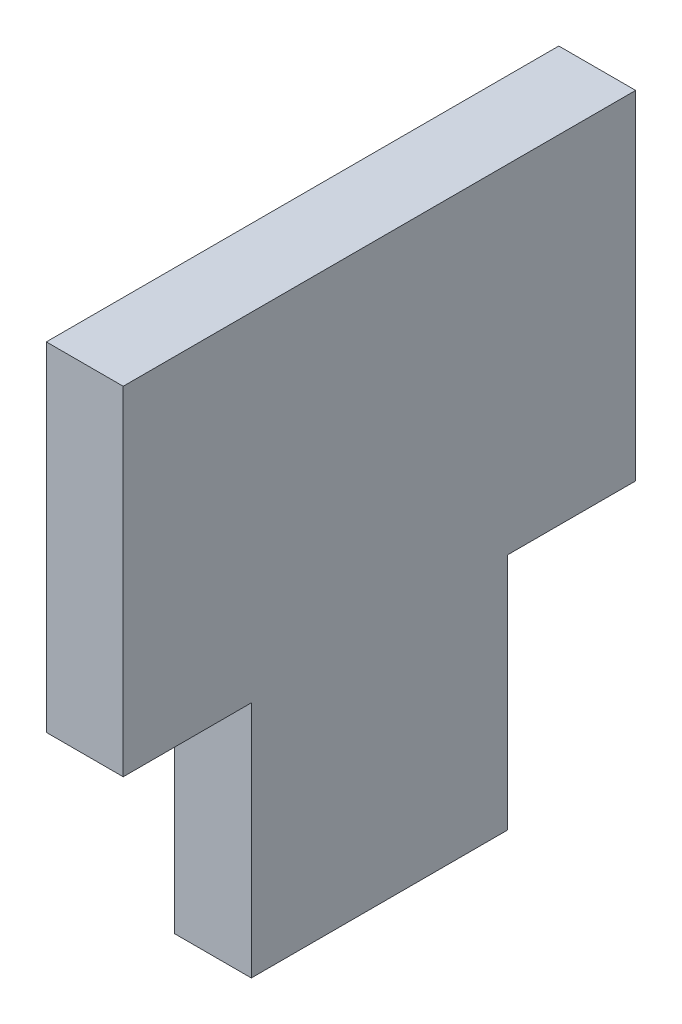
ISO-10303-21;
HEADER;
FILE_DESCRIPTION(('STEP AP214'),'2;1');
FILE_NAME('part.step','',(''),(''),'','','');
FILE_SCHEMA(('AUTOMOTIVE_DESIGN { 1 0 10303 214 1 1 1 1 }'));
ENDSEC;
DATA;
#1=APPLICATION_CONTEXT('core data for automotive mechanical design processes');
#2=APPLICATION_PROTOCOL_DEFINITION('international standard','automotive_design',2000,#1);
#3=PRODUCT_CONTEXT('',#1,'mechanical');
#4=PRODUCT('Part','Part','',(#3));
#5=PRODUCT_RELATED_PRODUCT_CATEGORY('part','',(#4));
#6=PRODUCT_DEFINITION_FORMATION('','',#4);
#7=PRODUCT_DEFINITION_CONTEXT('part definition',#1,'design');
#8=PRODUCT_DEFINITION('design','',#6,#7);
#9=PRODUCT_DEFINITION_SHAPE('','',#8);
#10=(LENGTH_UNIT() NAMED_UNIT(*) SI_UNIT(.MILLI.,.METRE.));
#11=(NAMED_UNIT(*) PLANE_ANGLE_UNIT() SI_UNIT($,.RADIAN.));
#12=(NAMED_UNIT(*) SI_UNIT($,.STERADIAN.) SOLID_ANGLE_UNIT());
#13=UNCERTAINTY_MEASURE_WITH_UNIT(LENGTH_MEASURE(1.E-05),#10,'distance_accuracy_value','');
#14=(GEOMETRIC_REPRESENTATION_CONTEXT(3) GLOBAL_UNCERTAINTY_ASSIGNED_CONTEXT((#13)) GLOBAL_UNIT_ASSIGNED_CONTEXT((#10,
#11,#12)) REPRESENTATION_CONTEXT('',''));
#15=CARTESIAN_POINT('',(0.,0.,0.));
#16=DIRECTION('',(0.,0.,1.));
#17=DIRECTION('',(1.,0.,0.));
#18=AXIS2_PLACEMENT_3D('',#15,#16,#17);
#19=CARTESIAN_POINT('',(3.,-6.6,-10.));
#20=DIRECTION('',(0.,0.,1.));
#21=DIRECTION('',(1.,0.,0.));
#22=AXIS2_PLACEMENT_3D('',#19,#20,#21);
#23=PLANE('',#22);
#24=DIRECTION('',(0.,1.,0.));
#25=VECTOR('',#24,1.);
#26=CARTESIAN_POINT('',(0.,-6.6,-10.));
#27=LINE('',#26,#25);
#28=CARTESIAN_POINT('',(0.,-6.6,-10.));
#29=VERTEX_POINT('',#28);
#30=CARTESIAN_POINT('',(0.,6.6,-10.));
#31=VERTEX_POINT('',#30);
#32=EDGE_CURVE('E131',#29,#31,#27,.T.);
#33=ORIENTED_EDGE('',*,*,#32,.T.);
#34=DIRECTION('',(-1.,0.,0.));
#35=VECTOR('',#34,1.);
#36=CARTESIAN_POINT('',(3.,6.6,-10.));
#37=LINE('',#36,#35);
#38=CARTESIAN_POINT('',(3.,6.6,-10.));
#39=VERTEX_POINT('',#38);
#40=EDGE_CURVE('E11',#39,#31,#37,.T.);
#41=ORIENTED_EDGE('',*,*,#40,.F.);
#42=DIRECTION('',(0.,1.,0.));
#43=VECTOR('',#42,1.);
#44=CARTESIAN_POINT('',(3.,-6.6,-10.));
#45=LINE('',#44,#43);
#46=CARTESIAN_POINT('',(3.,-6.6,-10.));
#47=VERTEX_POINT('',#46);
#48=EDGE_CURVE('E145',#47,#39,#45,.T.);
#49=ORIENTED_EDGE('',*,*,#48,.F.);
#50=DIRECTION('',(-1.,0.,0.));
#51=VECTOR('',#50,1.);
#52=CARTESIAN_POINT('',(3.,-6.6,-10.));
#53=LINE('',#52,#51);
#54=EDGE_CURVE('E127',#47,#29,#53,.T.);
#55=ORIENTED_EDGE('',*,*,#54,.T.);
#56=EDGE_LOOP('',(#33,#41,#49,#55));
#57=FACE_BOUND('',#56,.T.);
#58=ADVANCED_FACE('F35',(#57),#23,.F.);
#59=CARTESIAN_POINT('',(3.,6.6,10.));
#60=DIRECTION('',(0.,-1.,0.));
#61=DIRECTION('',(0.,0.,-1.));
#62=AXIS2_PLACEMENT_3D('',#59,#60,#61);
#63=PLANE('',#62);
#64=DIRECTION('',(0.,0.,1.));
#65=VECTOR('',#64,1.);
#66=CARTESIAN_POINT('',(0.,6.6,10.));
#67=LINE('',#66,#65);
#68=CARTESIAN_POINT('',(0.,6.6,10.));
#69=VERTEX_POINT('',#68);
#70=EDGE_CURVE('E134',#31,#69,#67,.T.);
#71=ORIENTED_EDGE('',*,*,#70,.T.);
#72=DIRECTION('',(-1.,0.,0.));
#73=VECTOR('',#72,1.);
#74=CARTESIAN_POINT('',(3.,6.6,10.));
#75=LINE('',#74,#73);
#76=CARTESIAN_POINT('',(3.,6.6,10.));
#77=VERTEX_POINT('',#76);
#78=EDGE_CURVE('E43',#77,#69,#75,.T.);
#79=ORIENTED_EDGE('',*,*,#78,.F.);
#80=DIRECTION('',(0.,0.,1.));
#81=VECTOR('',#80,1.);
#82=CARTESIAN_POINT('',(3.,6.6,10.));
#83=LINE('',#82,#81);
#84=EDGE_CURVE('E94',#39,#77,#83,.T.);
#85=ORIENTED_EDGE('',*,*,#84,.F.);
#86=ORIENTED_EDGE('',*,*,#40,.T.);
#87=EDGE_LOOP('',(#71,#79,#85,#86));
#88=FACE_BOUND('',#87,.T.);
#89=ADVANCED_FACE('F180',(#88),#63,.F.);
#90=CARTESIAN_POINT('',(3.,-6.6,10.));
#91=DIRECTION('',(0.,0.,-1.));
#92=DIRECTION('',(-1.,0.,0.));
#93=AXIS2_PLACEMENT_3D('',#90,#91,#92);
#94=PLANE('',#93);
#95=DIRECTION('',(0.,-1.,0.));
#96=VECTOR('',#95,1.);
#97=CARTESIAN_POINT('',(0.,-6.6,10.));
#98=LINE('',#97,#96);
#99=CARTESIAN_POINT('',(0.,-6.6,10.));
#100=VERTEX_POINT('',#99);
#101=EDGE_CURVE('E136',#69,#100,#98,.T.);
#102=ORIENTED_EDGE('',*,*,#101,.T.);
#103=DIRECTION('',(-1.,0.,0.));
#104=VECTOR('',#103,1.);
#105=CARTESIAN_POINT('',(3.,-6.6,10.));
#106=LINE('',#105,#104);
#107=CARTESIAN_POINT('',(3.,-6.6,10.));
#108=VERTEX_POINT('',#107);
#109=EDGE_CURVE('E152',#108,#100,#106,.T.);
#110=ORIENTED_EDGE('',*,*,#109,.F.);
#111=DIRECTION('',(0.,-1.,0.));
#112=VECTOR('',#111,1.);
#113=CARTESIAN_POINT('',(3.,-6.6,10.));
#114=LINE('',#113,#112);
#115=EDGE_CURVE('E160',#77,#108,#114,.T.);
#116=ORIENTED_EDGE('',*,*,#115,.F.);
#117=ORIENTED_EDGE('',*,*,#78,.T.);
#118=EDGE_LOOP('',(#102,#110,#116,#117));
#119=FACE_BOUND('',#118,.T.);
#120=ADVANCED_FACE('F158',(#119),#94,.F.);
#121=CARTESIAN_POINT('',(3.,-6.6,10.));
#122=DIRECTION('',(0.,1.,0.));
#123=DIRECTION('',(0.,0.,1.));
#124=AXIS2_PLACEMENT_3D('',#121,#122,#123);
#125=PLANE('',#124);
#126=DIRECTION('',(0.,0.,-1.));
#127=VECTOR('',#126,1.);
#128=CARTESIAN_POINT('',(0.,-6.6,10.));
#129=LINE('',#128,#127);
#130=CARTESIAN_POINT('',(0.,-6.6,5.));
#131=VERTEX_POINT('',#130);
#132=EDGE_CURVE('E138',#100,#131,#129,.T.);
#133=ORIENTED_EDGE('',*,*,#132,.T.);
#134=DIRECTION('',(-1.,0.,0.));
#135=VECTOR('',#134,1.);
#136=CARTESIAN_POINT('',(3.,-6.6,5.));
#137=LINE('',#136,#135);
#138=CARTESIAN_POINT('',(3.,-6.6,5.));
#139=VERTEX_POINT('',#138);
#140=EDGE_CURVE('E149',#139,#131,#137,.T.);
#141=ORIENTED_EDGE('',*,*,#140,.F.);
#142=DIRECTION('',(0.,0.,-1.));
#143=VECTOR('',#142,1.);
#144=CARTESIAN_POINT('',(3.,-6.6,10.));
#145=LINE('',#144,#143);
#146=EDGE_CURVE('E172',#108,#139,#145,.T.);
#147=ORIENTED_EDGE('',*,*,#146,.F.);
#148=ORIENTED_EDGE('',*,*,#109,.T.);
#149=EDGE_LOOP('',(#133,#141,#147,#148));
#150=FACE_BOUND('',#149,.T.);
#151=ADVANCED_FACE('F168',(#150),#125,.F.);
#152=CARTESIAN_POINT('',(3.,-6.6,5.));
#153=DIRECTION('',(0.,0.,-1.));
#154=DIRECTION('',(0.,1.,0.));
#155=AXIS2_PLACEMENT_3D('',#152,#153,#154);
#156=PLANE('',#155);
#157=DIRECTION('',(0.,-1.,0.));
#158=VECTOR('',#157,1.);
#159=CARTESIAN_POINT('',(0.,-6.6,5.));
#160=LINE('',#159,#158);
#161=CARTESIAN_POINT('',(0.,-15.9,5.));
#162=VERTEX_POINT('',#161);
#163=EDGE_CURVE('E140',#131,#162,#160,.T.);
#164=ORIENTED_EDGE('',*,*,#163,.T.);
#165=DIRECTION('',(-1.,0.,0.));
#166=VECTOR('',#165,1.);
#167=CARTESIAN_POINT('',(3.,-15.9,5.));
#168=LINE('',#167,#166);
#169=CARTESIAN_POINT('',(3.,-15.9,5.));
#170=VERTEX_POINT('',#169);
#171=EDGE_CURVE('E122',#170,#162,#168,.T.);
#172=ORIENTED_EDGE('',*,*,#171,.F.);
#173=DIRECTION('',(0.,-1.,0.));
#174=VECTOR('',#173,1.);
#175=CARTESIAN_POINT('',(3.,-6.6,5.));
#176=LINE('',#175,#174);
#177=EDGE_CURVE('E113',#139,#170,#176,.T.);
#178=ORIENTED_EDGE('',*,*,#177,.F.);
#179=ORIENTED_EDGE('',*,*,#140,.T.);
#180=EDGE_LOOP('',(#164,#172,#178,#179));
#181=FACE_BOUND('',#180,.T.);
#182=ADVANCED_FACE('F171',(#181),#156,.F.);
#183=CARTESIAN_POINT('',(3.,-15.9,5.));
#184=DIRECTION('',(0.,1.,0.));
#185=DIRECTION('',(0.,0.,1.));
#186=AXIS2_PLACEMENT_3D('',#183,#184,#185);
#187=PLANE('',#186);
#188=DIRECTION('',(0.,0.,-1.));
#189=VECTOR('',#188,1.);
#190=CARTESIAN_POINT('',(0.,-15.9,5.));
#191=LINE('',#190,#189);
#192=CARTESIAN_POINT('',(0.,-15.9,-5.));
#193=VERTEX_POINT('',#192);
#194=EDGE_CURVE('E121',#162,#193,#191,.T.);
#195=ORIENTED_EDGE('',*,*,#194,.T.);
#196=DIRECTION('',(-1.,0.,0.));
#197=VECTOR('',#196,1.);
#198=CARTESIAN_POINT('',(3.,-15.9,-5.));
#199=LINE('',#198,#197);
#200=CARTESIAN_POINT('',(3.,-15.9,-5.));
#201=VERTEX_POINT('',#200);
#202=EDGE_CURVE('E118',#201,#193,#199,.T.);
#203=ORIENTED_EDGE('',*,*,#202,.F.);
#204=DIRECTION('',(0.,0.,-1.));
#205=VECTOR('',#204,1.);
#206=CARTESIAN_POINT('',(3.,-15.9,5.));
#207=LINE('',#206,#205);
#208=EDGE_CURVE('E107',#170,#201,#207,.T.);
#209=ORIENTED_EDGE('',*,*,#208,.F.);
#210=ORIENTED_EDGE('',*,*,#171,.T.);
#211=EDGE_LOOP('',(#195,#203,#209,#210));
#212=FACE_BOUND('',#211,.T.);
#213=ADVANCED_FACE('F119',(#212),#187,.F.);
#214=CARTESIAN_POINT('',(3.,-15.9,-5.));
#215=DIRECTION('',(0.,0.,1.));
#216=DIRECTION('',(0.,-1.,0.));
#217=AXIS2_PLACEMENT_3D('',#214,#215,#216);
#218=PLANE('',#217);
#219=DIRECTION('',(0.,1.,0.));
#220=VECTOR('',#219,1.);
#221=CARTESIAN_POINT('',(0.,-15.9,-5.));
#222=LINE('',#221,#220);
#223=CARTESIAN_POINT('',(0.,-6.6,-5.));
#224=VERTEX_POINT('',#223);
#225=EDGE_CURVE('E80',#193,#224,#222,.T.);
#226=ORIENTED_EDGE('',*,*,#225,.T.);
#227=DIRECTION('',(-1.,0.,0.));
#228=VECTOR('',#227,1.);
#229=CARTESIAN_POINT('',(3.,-6.6,-5.));
#230=LINE('',#229,#228);
#231=CARTESIAN_POINT('',(3.,-6.6,-5.));
#232=VERTEX_POINT('',#231);
#233=EDGE_CURVE('E123',#232,#224,#230,.T.);
#234=ORIENTED_EDGE('',*,*,#233,.F.);
#235=DIRECTION('',(0.,1.,0.));
#236=VECTOR('',#235,1.);
#237=CARTESIAN_POINT('',(3.,-15.9,-5.));
#238=LINE('',#237,#236);
#239=EDGE_CURVE('E111',#201,#232,#238,.T.);
#240=ORIENTED_EDGE('',*,*,#239,.F.);
#241=ORIENTED_EDGE('',*,*,#202,.T.);
#242=EDGE_LOOP('',(#226,#234,#240,#241));
#243=FACE_BOUND('',#242,.T.);
#244=ADVANCED_FACE('F125',(#243),#218,.F.);
#245=CARTESIAN_POINT('',(3.,-6.6,-5.));
#246=DIRECTION('',(0.,1.,0.));
#247=DIRECTION('',(0.,0.,1.));
#248=AXIS2_PLACEMENT_3D('',#245,#246,#247);
#249=PLANE('',#248);
#250=DIRECTION('',(0.,0.,-1.));
#251=VECTOR('',#250,1.);
#252=CARTESIAN_POINT('',(0.,-6.6,-5.));
#253=LINE('',#252,#251);
#254=EDGE_CURVE('E86',#224,#29,#253,.T.);
#255=ORIENTED_EDGE('',*,*,#254,.T.);
#256=ORIENTED_EDGE('',*,*,#54,.F.);
#257=DIRECTION('',(0.,0.,-1.));
#258=VECTOR('',#257,1.);
#259=CARTESIAN_POINT('',(3.,-6.6,-5.));
#260=LINE('',#259,#258);
#261=EDGE_CURVE('E51',#232,#47,#260,.T.);
#262=ORIENTED_EDGE('',*,*,#261,.F.);
#263=ORIENTED_EDGE('',*,*,#233,.T.);
#264=EDGE_LOOP('',(#255,#256,#262,#263));
#265=FACE_BOUND('',#264,.T.);
#266=ADVANCED_FACE('F196',(#265),#249,.F.);
#267=CARTESIAN_POINT('',(3.,0.,0.));
#268=DIRECTION('',(-1.,0.,0.));
#269=DIRECTION('',(0.,0.,1.));
#270=AXIS2_PLACEMENT_3D('',#267,#268,#269);
#271=PLANE('',#270);
#272=ORIENTED_EDGE('',*,*,#48,.T.);
#273=ORIENTED_EDGE('',*,*,#84,.T.);
#274=ORIENTED_EDGE('',*,*,#115,.T.);
#275=ORIENTED_EDGE('',*,*,#146,.T.);
#276=ORIENTED_EDGE('',*,*,#177,.T.);
#277=ORIENTED_EDGE('',*,*,#208,.T.);
#278=ORIENTED_EDGE('',*,*,#239,.T.);
#279=ORIENTED_EDGE('',*,*,#261,.T.);
#280=EDGE_LOOP('',(#272,#273,#274,#275,#276,#277,#278,#279));
#281=FACE_BOUND('',#280,.T.);
#282=ADVANCED_FACE('F109',(#281),#271,.F.);
#283=CARTESIAN_POINT('',(0.,0.,0.));
#284=DIRECTION('',(-1.,0.,0.));
#285=DIRECTION('',(0.,0.,1.));
#286=AXIS2_PLACEMENT_3D('',#283,#284,#285);
#287=PLANE('',#286);
#288=ORIENTED_EDGE('',*,*,#32,.F.);
#289=ORIENTED_EDGE('',*,*,#254,.F.);
#290=ORIENTED_EDGE('',*,*,#225,.F.);
#291=ORIENTED_EDGE('',*,*,#194,.F.);
#292=ORIENTED_EDGE('',*,*,#163,.F.);
#293=ORIENTED_EDGE('',*,*,#132,.F.);
#294=ORIENTED_EDGE('',*,*,#101,.F.);
#295=ORIENTED_EDGE('',*,*,#70,.F.);
#296=EDGE_LOOP('',(#288,#289,#290,#291,#292,#293,#294,#295));
#297=FACE_BOUND('',#296,.T.);
#298=ADVANCED_FACE('F164',(#297),#287,.T.);
#299=CLOSED_SHELL('',(#58,#89,#120,#151,#182,#213,#244,#266,#282,#298));
#300=MANIFOLD_SOLID_BREP('B2',#299);
#301=ADVANCED_BREP_SHAPE_REPRESENTATION('',(#18,#300),#14);
#302=SHAPE_DEFINITION_REPRESENTATION(#9,#301);
ENDSEC;
END-ISO-10303-21;
